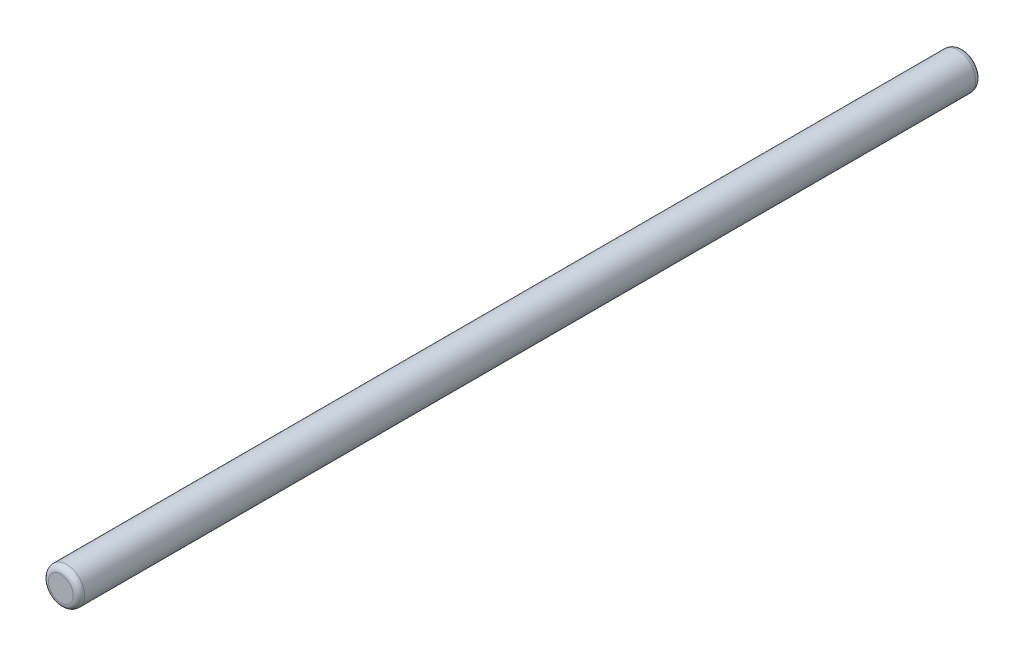
ISO-10303-21;
HEADER;
FILE_DESCRIPTION(('STEP AP214'),'2;1');
FILE_NAME('part.step','',(''),(''),'','','');
FILE_SCHEMA(('AUTOMOTIVE_DESIGN { 1 0 10303 214 1 1 1 1 }'));
ENDSEC;
DATA;
#1=APPLICATION_CONTEXT('core data for automotive mechanical design processes');
#2=APPLICATION_PROTOCOL_DEFINITION('international standard','automotive_design',2000,#1);
#3=PRODUCT_CONTEXT('',#1,'mechanical');
#4=PRODUCT('Part','Part','',(#3));
#5=PRODUCT_RELATED_PRODUCT_CATEGORY('part','',(#4));
#6=PRODUCT_DEFINITION_FORMATION('','',#4);
#7=PRODUCT_DEFINITION_CONTEXT('part definition',#1,'design');
#8=PRODUCT_DEFINITION('design','',#6,#7);
#9=PRODUCT_DEFINITION_SHAPE('','',#8);
#10=(LENGTH_UNIT() NAMED_UNIT(*) SI_UNIT(.MILLI.,.METRE.));
#11=(NAMED_UNIT(*) PLANE_ANGLE_UNIT() SI_UNIT($,.RADIAN.));
#12=(NAMED_UNIT(*) SI_UNIT($,.STERADIAN.) SOLID_ANGLE_UNIT());
#13=UNCERTAINTY_MEASURE_WITH_UNIT(LENGTH_MEASURE(1.E-05),#10,'distance_accuracy_value','');
#14=(GEOMETRIC_REPRESENTATION_CONTEXT(3) GLOBAL_UNCERTAINTY_ASSIGNED_CONTEXT((#13)) GLOBAL_UNIT_ASSIGNED_CONTEXT((#10,
#11,#12)) REPRESENTATION_CONTEXT('',''));
#15=CARTESIAN_POINT('',(0.,0.,0.));
#16=DIRECTION('',(0.,0.,1.));
#17=DIRECTION('',(1.,0.,0.));
#18=AXIS2_PLACEMENT_3D('',#15,#16,#17);
#19=CARTESIAN_POINT('',(0.,0.,39.5));
#20=DIRECTION('',(0.,0.,1.));
#21=DIRECTION('',(1.,0.,0.));
#22=AXIS2_PLACEMENT_3D('',#19,#20,#21);
#23=PLANE('',#22);
#24=CARTESIAN_POINT('',(0.,0.,39.5));
#25=DIRECTION('',(0.,0.,-1.));
#26=DIRECTION('',(-1.,0.,0.));
#27=AXIS2_PLACEMENT_3D('',#24,#25,#26);
#28=CIRCLE('',#27,1.0875);
#29=CARTESIAN_POINT('',(-1.0875,0.,39.5));
#30=VERTEX_POINT('',#29);
#31=CARTESIAN_POINT('',(1.0875,0.,39.5));
#32=VERTEX_POINT('',#31);
#33=EDGE_CURVE('E50',#30,#32,#28,.T.);
#34=ORIENTED_EDGE('',*,*,#33,.F.);
#35=CARTESIAN_POINT('',(0.,0.,39.5));
#36=DIRECTION('',(0.,0.,-1.));
#37=DIRECTION('',(1.,0.,0.));
#38=AXIS2_PLACEMENT_3D('',#35,#36,#37);
#39=CIRCLE('',#38,1.0875);
#40=EDGE_CURVE('E46',#32,#30,#39,.T.);
#41=ORIENTED_EDGE('',*,*,#40,.F.);
#42=EDGE_LOOP('',(#34,#41));
#43=FACE_BOUND('',#42,.T.);
#44=ADVANCED_FACE('F17',(#43),#23,.T.);
#45=CARTESIAN_POINT('',(0.,0.,-39.5));
#46=DIRECTION('',(0.,0.,1.));
#47=DIRECTION('',(1.,0.,0.));
#48=AXIS2_PLACEMENT_3D('',#45,#46,#47);
#49=PLANE('',#48);
#50=CARTESIAN_POINT('',(0.,0.,-39.5));
#51=DIRECTION('',(0.,0.,1.));
#52=DIRECTION('',(1.,0.,0.));
#53=AXIS2_PLACEMENT_3D('',#50,#51,#52);
#54=CIRCLE('',#53,1.0875);
#55=CARTESIAN_POINT('',(1.0875,0.,-39.5));
#56=VERTEX_POINT('',#55);
#57=CARTESIAN_POINT('',(-1.0875,0.,-39.5));
#58=VERTEX_POINT('',#57);
#59=EDGE_CURVE('E57',#56,#58,#54,.T.);
#60=ORIENTED_EDGE('',*,*,#59,.F.);
#61=CARTESIAN_POINT('',(0.,0.,-39.5));
#62=DIRECTION('',(0.,0.,1.));
#63=DIRECTION('',(-1.,0.,0.));
#64=AXIS2_PLACEMENT_3D('',#61,#62,#63);
#65=CIRCLE('',#64,1.0875);
#66=EDGE_CURVE('E37',#58,#56,#65,.T.);
#67=ORIENTED_EDGE('',*,*,#66,.F.);
#68=EDGE_LOOP('',(#60,#67));
#69=FACE_BOUND('',#68,.T.);
#70=ADVANCED_FACE('F75',(#69),#49,.F.);
#71=CARTESIAN_POINT('',(0.,0.,39.));
#72=DIRECTION('',(0.,0.,1.));
#73=DIRECTION('',(1.,0.,0.));
#74=AXIS2_PLACEMENT_3D('',#71,#72,#73);
#75=TOROIDAL_SURFACE('',#74,1.0875,0.5);
#76=ORIENTED_EDGE('',*,*,#40,.T.);
#77=ORIENTED_EDGE('',*,*,#33,.T.);
#78=EDGE_LOOP('',(#76,#77));
#79=FACE_BOUND('',#78,.T.);
#80=CARTESIAN_POINT('',(0.,0.,39.));
#81=DIRECTION('',(0.,0.,-1.));
#82=DIRECTION('',(-1.,0.,0.));
#83=AXIS2_PLACEMENT_3D('',#80,#81,#82);
#84=CIRCLE('',#83,1.5875);
#85=CARTESIAN_POINT('',(-1.5875,0.,39.));
#86=VERTEX_POINT('',#85);
#87=EDGE_CURVE('E29',#86,#86,#84,.T.);
#88=ORIENTED_EDGE('',*,*,#87,.F.);
#89=EDGE_LOOP('',(#88));
#90=FACE_BOUND('',#89,.T.);
#91=ADVANCED_FACE('F55',(#79,#90),#75,.T.);
#92=CARTESIAN_POINT('',(0.,0.,-39.));
#93=DIRECTION('',(0.,0.,1.));
#94=DIRECTION('',(1.,0.,0.));
#95=AXIS2_PLACEMENT_3D('',#92,#93,#94);
#96=TOROIDAL_SURFACE('',#95,1.0875,0.5);
#97=CARTESIAN_POINT('',(0.,0.,-39.));
#98=DIRECTION('',(0.,0.,-1.));
#99=DIRECTION('',(-1.,0.,0.));
#100=AXIS2_PLACEMENT_3D('',#97,#98,#99);
#101=CIRCLE('',#100,1.5875);
#102=CARTESIAN_POINT('',(-1.5875,0.,-39.));
#103=VERTEX_POINT('',#102);
#104=EDGE_CURVE('E11',#103,#103,#101,.F.);
#105=ORIENTED_EDGE('',*,*,#104,.F.);
#106=EDGE_LOOP('',(#105));
#107=FACE_BOUND('',#106,.T.);
#108=ORIENTED_EDGE('',*,*,#59,.T.);
#109=ORIENTED_EDGE('',*,*,#66,.T.);
#110=EDGE_LOOP('',(#108,#109));
#111=FACE_BOUND('',#110,.T.);
#112=ADVANCED_FACE('F74',(#107,#111),#96,.T.);
#113=CARTESIAN_POINT('',(0.,0.,39.5));
#114=DIRECTION('',(0.,0.,-1.));
#115=DIRECTION('',(-1.,0.,0.));
#116=AXIS2_PLACEMENT_3D('',#113,#114,#115);
#117=CYLINDRICAL_SURFACE('',#116,1.5875);
#118=ORIENTED_EDGE('',*,*,#104,.T.);
#119=EDGE_LOOP('',(#118));
#120=FACE_BOUND('',#119,.T.);
#121=ORIENTED_EDGE('',*,*,#87,.T.);
#122=EDGE_LOOP('',(#121));
#123=FACE_BOUND('',#122,.T.);
#124=ADVANCED_FACE('F120',(#120,#123),#117,.T.);
#125=CLOSED_SHELL('',(#44,#70,#91,#112,#124));
#126=MANIFOLD_SOLID_BREP('B1',#125);
#127=ADVANCED_BREP_SHAPE_REPRESENTATION('',(#18,#126),#14);
#128=SHAPE_DEFINITION_REPRESENTATION(#9,#127);
ENDSEC;
END-ISO-10303-21;
